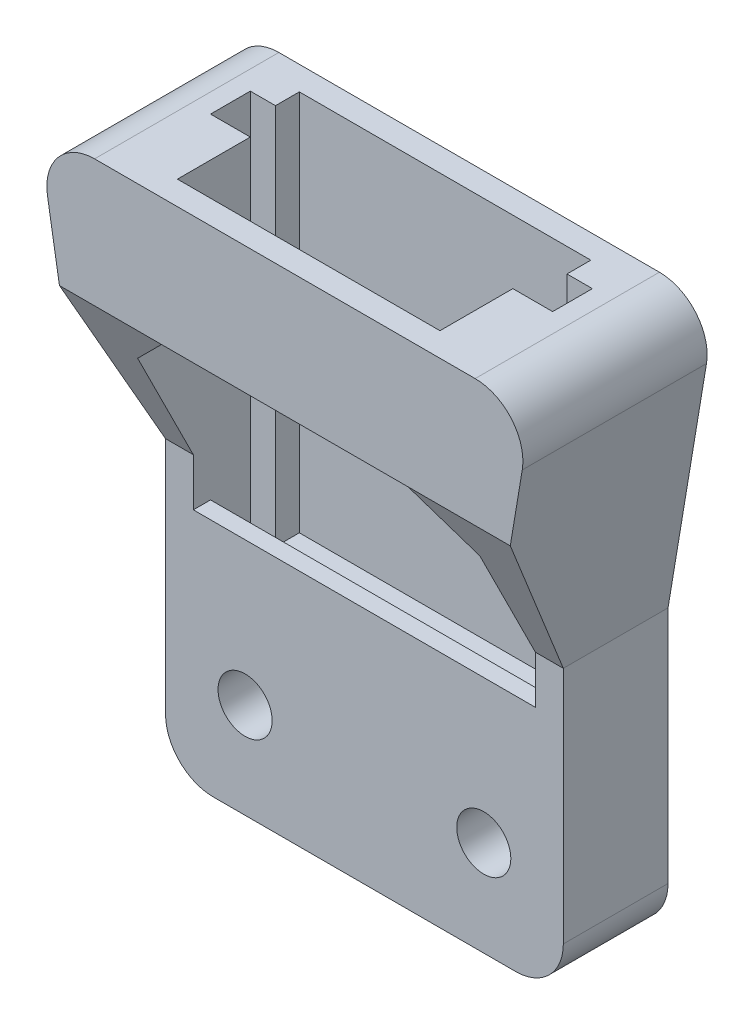
ISO-10303-21;
HEADER;
FILE_DESCRIPTION(('STEP AP214'),'2;1');
FILE_NAME('part.step','',(''),(''),'','','');
FILE_SCHEMA(('AUTOMOTIVE_DESIGN { 1 0 10303 214 1 1 1 1 }'));
ENDSEC;
DATA;
#1=APPLICATION_CONTEXT('core data for automotive mechanical design processes');
#2=APPLICATION_PROTOCOL_DEFINITION('international standard','automotive_design',2000,#1);
#3=PRODUCT_CONTEXT('',#1,'mechanical');
#4=PRODUCT('Part','Part','',(#3));
#5=PRODUCT_RELATED_PRODUCT_CATEGORY('part','',(#4));
#6=PRODUCT_DEFINITION_FORMATION('','',#4);
#7=PRODUCT_DEFINITION_CONTEXT('part definition',#1,'design');
#8=PRODUCT_DEFINITION('design','',#6,#7);
#9=PRODUCT_DEFINITION_SHAPE('','',#8);
#10=(LENGTH_UNIT() NAMED_UNIT(*) SI_UNIT(.MILLI.,.METRE.));
#11=(NAMED_UNIT(*) PLANE_ANGLE_UNIT() SI_UNIT($,.RADIAN.));
#12=(NAMED_UNIT(*) SI_UNIT($,.STERADIAN.) SOLID_ANGLE_UNIT());
#13=UNCERTAINTY_MEASURE_WITH_UNIT(LENGTH_MEASURE(1.E-05),#10,'distance_accuracy_value','');
#14=(GEOMETRIC_REPRESENTATION_CONTEXT(3) GLOBAL_UNCERTAINTY_ASSIGNED_CONTEXT((#13)) GLOBAL_UNIT_ASSIGNED_CONTEXT((#10,
#11,#12)) REPRESENTATION_CONTEXT('',''));
#15=CARTESIAN_POINT('',(0.,0.,0.));
#16=DIRECTION('',(0.,0.,1.));
#17=DIRECTION('',(1.,0.,0.));
#18=AXIS2_PLACEMENT_3D('',#15,#16,#17);
#19=CARTESIAN_POINT('',(-10.75265360096,-119.,-47.5078940808788));
#20=DIRECTION('',(1.,0.,0.));
#21=DIRECTION('',(0.,1.,0.));
#22=AXIS2_PLACEMENT_3D('',#19,#20,#21);
#23=PLANE('',#22);
#24=DIRECTION('',(0.,1.,0.));
#25=VECTOR('',#24,1.);
#26=CARTESIAN_POINT('',(-10.75265360096,-127.,5.49999999999998));
#27=LINE('',#26,#25);
#28=CARTESIAN_POINT('',(-10.75265360096,-130.,5.49999999999998));
#29=VERTEX_POINT('',#28);
#30=CARTESIAN_POINT('',(-10.75265360096,-119.,5.49999999999998));
#31=VERTEX_POINT('',#30);
#32=EDGE_CURVE('E313',#29,#31,#27,.T.);
#33=ORIENTED_EDGE('',*,*,#32,.F.);
#34=DIRECTION('',(0.,0.,1.));
#35=VECTOR('',#34,1.);
#36=CARTESIAN_POINT('',(-10.75265360096,-130.,-47.5078940808788));
#37=LINE('',#36,#35);
#38=CARTESIAN_POINT('',(-10.75265360096,-130.,10.0800000000001));
#39=VERTEX_POINT('',#38);
#40=EDGE_CURVE('E426',#29,#39,#37,.T.);
#41=ORIENTED_EDGE('',*,*,#40,.T.);
#42=DIRECTION('',(0.,-0.894427190999916,-0.447213595499957));
#43=VECTOR('',#42,1.);
#44=CARTESIAN_POINT('',(-10.75265360096,-144.235157632352,2.96242118382435));
#45=LINE('',#44,#43);
#46=CARTESIAN_POINT('',(-10.75265360096,-137.,6.58000000000013));
#47=VERTEX_POINT('',#46);
#48=EDGE_CURVE('E418',#39,#47,#45,.T.);
#49=ORIENTED_EDGE('',*,*,#48,.T.);
#50=DIRECTION('',(0.,1.,0.));
#51=VECTOR('',#50,1.);
#52=CARTESIAN_POINT('',(-10.75265360096,-119.,6.58000000000013));
#53=LINE('',#52,#51);
#54=CARTESIAN_POINT('',(-10.75265360096,-140.,6.58000000000013));
#55=VERTEX_POINT('',#54);
#56=EDGE_CURVE('E278',#55,#47,#53,.T.);
#57=ORIENTED_EDGE('',*,*,#56,.F.);
#58=DIRECTION('',(0.,0.,-1.));
#59=VECTOR('',#58,1.);
#60=CARTESIAN_POINT('',(-10.75265360096,-140.,33.9015142855497));
#61=LINE('',#60,#59);
#62=CARTESIAN_POINT('',(-10.75265360096,-140.,5.49999999999999));
#63=VERTEX_POINT('',#62);
#64=EDGE_CURVE('E330',#55,#63,#61,.T.);
#65=ORIENTED_EDGE('',*,*,#64,.T.);
#66=DIRECTION('',(0.,-1.,0.));
#67=VECTOR('',#66,1.);
#68=CARTESIAN_POINT('',(-10.7526536009601,0.,5.49999999999999));
#69=LINE('',#68,#67);
#70=CARTESIAN_POINT('',(-10.75265360096,-146.,5.49999999999999));
#71=VERTEX_POINT('',#70);
#72=EDGE_CURVE('E327',#63,#71,#69,.T.);
#73=ORIENTED_EDGE('',*,*,#72,.T.);
#74=DIRECTION('',(0.,0.,1.));
#75=VECTOR('',#74,1.);
#76=CARTESIAN_POINT('',(-10.75265360096,-146.,-47.5078940808788));
#77=LINE('',#76,#75);
#78=CARTESIAN_POINT('',(-10.75265360096,-146.,2.99999999999997));
#79=VERTEX_POINT('',#78);
#80=EDGE_CURVE('E350',#79,#71,#77,.T.);
#81=ORIENTED_EDGE('',*,*,#80,.F.);
#82=DIRECTION('',(0.,1.,0.));
#83=VECTOR('',#82,1.);
#84=CARTESIAN_POINT('',(-10.75265360096,-132.3,2.99999999999998));
#85=LINE('',#84,#83);
#86=CARTESIAN_POINT('',(-10.75265360096,-119.,2.99999999999998));
#87=VERTEX_POINT('',#86);
#88=EDGE_CURVE('E407',#79,#87,#85,.T.);
#89=ORIENTED_EDGE('',*,*,#88,.T.);
#90=DIRECTION('',(0.,0.,1.));
#91=VECTOR('',#90,1.);
#92=CARTESIAN_POINT('',(-10.75265360096,-119.,-47.5078940808788));
#93=LINE('',#92,#91);
#94=EDGE_CURVE('E345',#87,#31,#93,.T.);
#95=ORIENTED_EDGE('',*,*,#94,.T.);
#96=EDGE_LOOP('',(#33,#41,#49,#57,#65,#73,#81,#89,#95));
#97=FACE_BOUND('',#96,.T.);
#98=ADVANCED_FACE('F41',(#97),#23,.T.);
#99=CARTESIAN_POINT('',(10.74734639904,-146.,-47.5078940808788));
#100=DIRECTION('',(0.,1.,0.));
#101=DIRECTION('',(0.,0.,1.));
#102=AXIS2_PLACEMENT_3D('',#99,#100,#101);
#103=PLANE('',#102);
#104=ORIENTED_EDGE('',*,*,#80,.T.);
#105=DIRECTION('',(1.,0.,0.));
#106=VECTOR('',#105,1.);
#107=CARTESIAN_POINT('',(0.,-146.,5.49999999999999));
#108=LINE('',#107,#106);
#109=CARTESIAN_POINT('',(10.74734639904,-146.,5.49999999999999));
#110=VERTEX_POINT('',#109);
#111=EDGE_CURVE('E324',#71,#110,#108,.T.);
#112=ORIENTED_EDGE('',*,*,#111,.T.);
#113=DIRECTION('',(0.,0.,1.));
#114=VECTOR('',#113,1.);
#115=CARTESIAN_POINT('',(10.74734639904,-146.,-47.5078940808788));
#116=LINE('',#115,#114);
#117=CARTESIAN_POINT('',(10.74734639904,-146.,2.99999999999997));
#118=VERTEX_POINT('',#117);
#119=EDGE_CURVE('E353',#118,#110,#116,.T.);
#120=ORIENTED_EDGE('',*,*,#119,.F.);
#121=DIRECTION('',(-1.,0.,0.));
#122=VECTOR('',#121,1.);
#123=CARTESIAN_POINT('',(-0.0106144039450154,-146.,2.99999999999997));
#124=LINE('',#123,#122);
#125=EDGE_CURVE('E404',#118,#79,#124,.T.);
#126=ORIENTED_EDGE('',*,*,#125,.T.);
#127=EDGE_LOOP('',(#104,#112,#120,#126));
#128=FACE_BOUND('',#127,.T.);
#129=ADVANCED_FACE('F526',(#128),#103,.T.);
#130=CARTESIAN_POINT('',(0.,0.,0.));
#131=DIRECTION('',(0.,0.,1.));
#132=DIRECTION('',(1.,0.,0.));
#133=AXIS2_PLACEMENT_3D('',#130,#131,#132);
#134=PLANE('',#133);
#135=CARTESIAN_POINT('',(7.50000000000001,-149.,0.));
#136=DIRECTION('',(0.,0.,1.));
#137=DIRECTION('',(1.,0.,0.));
#138=AXIS2_PLACEMENT_3D('',#135,#136,#137);
#139=CIRCLE('',#138,1.7);
#140=CARTESIAN_POINT('',(9.20000000000001,-149.,0.));
#141=VERTEX_POINT('',#140);
#142=EDGE_CURVE('E1064',#141,#141,#139,.T.);
#143=ORIENTED_EDGE('',*,*,#142,.T.);
#144=EDGE_LOOP('',(#143));
#145=FACE_BOUND('',#144,.T.);
#146=CARTESIAN_POINT('',(-7.49999999999999,-149.,0.));
#147=DIRECTION('',(0.,0.,1.));
#148=DIRECTION('',(1.,0.,0.));
#149=AXIS2_PLACEMENT_3D('',#146,#147,#148);
#150=CIRCLE('',#149,1.7);
#151=CARTESIAN_POINT('',(-5.79999999999999,-149.,0.));
#152=VERTEX_POINT('',#151);
#153=EDGE_CURVE('E1074',#152,#152,#150,.T.);
#154=ORIENTED_EDGE('',*,*,#153,.T.);
#155=EDGE_LOOP('',(#154));
#156=FACE_BOUND('',#155,.T.);
#157=DIRECTION('',(1.,0.,0.));
#158=VECTOR('',#157,1.);
#159=CARTESIAN_POINT('',(-12.5,-155.,0.));
#160=LINE('',#159,#158);
#161=CARTESIAN_POINT('',(-9.5,-155.,0.));
#162=VERTEX_POINT('',#161);
#163=CARTESIAN_POINT('',(9.5,-155.,0.));
#164=VERTEX_POINT('',#163);
#165=EDGE_CURVE('E393',#162,#164,#160,.T.);
#166=ORIENTED_EDGE('',*,*,#165,.F.);
#167=CARTESIAN_POINT('',(-9.5,-152.,0.));
#168=DIRECTION('',(0.,0.,1.));
#169=DIRECTION('',(1.,0.,0.));
#170=AXIS2_PLACEMENT_3D('',#167,#168,#169);
#171=CIRCLE('',#170,3.);
#172=CARTESIAN_POINT('',(-12.5,-152.,0.));
#173=VERTEX_POINT('',#172);
#174=EDGE_CURVE('E477',#162,#173,#171,.F.);
#175=ORIENTED_EDGE('',*,*,#174,.T.);
#176=DIRECTION('',(0.,-1.,0.));
#177=VECTOR('',#176,1.);
#178=CARTESIAN_POINT('',(-12.5,-119.,0.));
#179=LINE('',#178,#177);
#180=CARTESIAN_POINT('',(-12.5,-137.,0.));
#181=VERTEX_POINT('',#180);
#182=EDGE_CURVE('E398',#181,#173,#179,.T.);
#183=ORIENTED_EDGE('',*,*,#182,.F.);
#184=DIRECTION('',(-0.164398987305358,0.986393923832144,0.));
#185=VECTOR('',#184,1.);
#186=CARTESIAN_POINT('',(-15.5,-119.,0.));
#187=LINE('',#186,#185);
#188=CARTESIAN_POINT('',(-14.9178005063473,-122.493196961916,0.));
#189=VERTEX_POINT('',#188);
#190=EDGE_CURVE('E341',#181,#189,#187,.T.);
#191=ORIENTED_EDGE('',*,*,#190,.T.);
#192=CARTESIAN_POINT('',(-11.9586187348509,-122.,0.));
#193=DIRECTION('',(0.,0.,1.));
#194=DIRECTION('',(1.,0.,0.));
#195=AXIS2_PLACEMENT_3D('',#192,#193,#194);
#196=CIRCLE('',#195,3.);
#197=CARTESIAN_POINT('',(-11.9586187348509,-119.,0.));
#198=VERTEX_POINT('',#197);
#199=EDGE_CURVE('E464',#189,#198,#196,.F.);
#200=ORIENTED_EDGE('',*,*,#199,.T.);
#201=DIRECTION('',(-1.,0.,0.));
#202=VECTOR('',#201,1.);
#203=CARTESIAN_POINT('',(-12.5,-119.,0.));
#204=LINE('',#203,#202);
#205=CARTESIAN_POINT('',(11.9586187348509,-119.,0.));
#206=VERTEX_POINT('',#205);
#207=EDGE_CURVE('E395',#206,#198,#204,.T.);
#208=ORIENTED_EDGE('',*,*,#207,.F.);
#209=CARTESIAN_POINT('',(11.9586187348509,-122.,0.));
#210=DIRECTION('',(0.,0.,1.));
#211=DIRECTION('',(1.,0.,0.));
#212=AXIS2_PLACEMENT_3D('',#209,#210,#211);
#213=CIRCLE('',#212,3.);
#214=CARTESIAN_POINT('',(14.9178005063473,-122.493196961916,0.));
#215=VERTEX_POINT('',#214);
#216=EDGE_CURVE('E466',#206,#215,#213,.F.);
#217=ORIENTED_EDGE('',*,*,#216,.T.);
#218=DIRECTION('',(-0.164398987305358,-0.986393923832144,0.));
#219=VECTOR('',#218,1.);
#220=CARTESIAN_POINT('',(15.5,-119.,0.));
#221=LINE('',#220,#219);
#222=CARTESIAN_POINT('',(12.5,-137.,0.));
#223=VERTEX_POINT('',#222);
#224=EDGE_CURVE('E344',#215,#223,#221,.T.);
#225=ORIENTED_EDGE('',*,*,#224,.T.);
#226=DIRECTION('',(0.,1.,0.));
#227=VECTOR('',#226,1.);
#228=CARTESIAN_POINT('',(12.5,-119.,0.));
#229=LINE('',#228,#227);
#230=CARTESIAN_POINT('',(12.5,-152.,0.));
#231=VERTEX_POINT('',#230);
#232=EDGE_CURVE('E268',#231,#223,#229,.T.);
#233=ORIENTED_EDGE('',*,*,#232,.F.);
#234=CARTESIAN_POINT('',(9.5,-152.,0.));
#235=DIRECTION('',(0.,0.,1.));
#236=DIRECTION('',(1.,0.,0.));
#237=AXIS2_PLACEMENT_3D('',#234,#235,#236);
#238=CIRCLE('',#237,3.);
#239=EDGE_CURVE('E475',#231,#164,#238,.F.);
#240=ORIENTED_EDGE('',*,*,#239,.T.);
#241=EDGE_LOOP('',(#166,#175,#183,#191,#200,#208,#217,#225,#233,#240));
#242=FACE_BOUND('',#241,.T.);
#243=ADVANCED_FACE('F492',(#145,#156,#242),#134,.F.);
#244=CARTESIAN_POINT('',(-12.5,-155.,45.3292140016222));
#245=DIRECTION('',(0.,1.,0.));
#246=DIRECTION('',(0.,0.,1.));
#247=AXIS2_PLACEMENT_3D('',#244,#245,#246);
#248=PLANE('',#247);
#249=DIRECTION('',(1.,0.,0.));
#250=VECTOR('',#249,1.);
#251=CARTESIAN_POINT('',(-12.5,-155.,6.58000000000013));
#252=LINE('',#251,#250);
#253=CARTESIAN_POINT('',(-9.5,-155.,6.58000000000013));
#254=VERTEX_POINT('',#253);
#255=CARTESIAN_POINT('',(9.5,-155.,6.58000000000013));
#256=VERTEX_POINT('',#255);
#257=EDGE_CURVE('E249',#254,#256,#252,.T.);
#258=ORIENTED_EDGE('',*,*,#257,.F.);
#259=DIRECTION('',(0.,0.,-1.));
#260=VECTOR('',#259,1.);
#261=CARTESIAN_POINT('',(-9.5,-155.,45.3292140016222));
#262=LINE('',#261,#260);
#263=EDGE_CURVE('E472',#254,#162,#262,.T.);
#264=ORIENTED_EDGE('',*,*,#263,.T.);
#265=ORIENTED_EDGE('',*,*,#165,.T.);
#266=DIRECTION('',(0.,0.,-1.));
#267=VECTOR('',#266,1.);
#268=CARTESIAN_POINT('',(9.5,-155.,45.3292140016222));
#269=LINE('',#268,#267);
#270=EDGE_CURVE('E470',#164,#256,#269,.F.);
#271=ORIENTED_EDGE('',*,*,#270,.T.);
#272=EDGE_LOOP('',(#258,#264,#265,#271));
#273=FACE_BOUND('',#272,.T.);
#274=ADVANCED_FACE('F486',(#273),#248,.F.);
#275=CARTESIAN_POINT('',(-12.5,-119.,45.3292140016222));
#276=DIRECTION('',(1.,0.,0.));
#277=DIRECTION('',(0.,0.,-1.));
#278=AXIS2_PLACEMENT_3D('',#275,#276,#277);
#279=PLANE('',#278);
#280=ORIENTED_EDGE('',*,*,#182,.T.);
#281=DIRECTION('',(0.,0.,-1.));
#282=VECTOR('',#281,1.);
#283=CARTESIAN_POINT('',(-12.5,-152.,45.3292140016222));
#284=LINE('',#283,#282);
#285=CARTESIAN_POINT('',(-12.5,-152.,6.58000000000013));
#286=VERTEX_POINT('',#285);
#287=EDGE_CURVE('E64',#173,#286,#284,.F.);
#288=ORIENTED_EDGE('',*,*,#287,.T.);
#289=DIRECTION('',(0.,-1.,0.));
#290=VECTOR('',#289,1.);
#291=CARTESIAN_POINT('',(-12.5,-155.,6.58000000000013));
#292=LINE('',#291,#290);
#293=CARTESIAN_POINT('',(-12.5,-137.,6.58000000000013));
#294=VERTEX_POINT('',#293);
#295=EDGE_CURVE('E482',#294,#286,#292,.T.);
#296=ORIENTED_EDGE('',*,*,#295,.F.);
#297=DIRECTION('',(0.,0.,1.));
#298=VECTOR('',#297,1.);
#299=CARTESIAN_POINT('',(-12.5,-137.,-47.5078940808788));
#300=LINE('',#299,#298);
#301=EDGE_CURVE('E271',#181,#294,#300,.T.);
#302=ORIENTED_EDGE('',*,*,#301,.F.);
#303=EDGE_LOOP('',(#280,#288,#296,#302));
#304=FACE_BOUND('',#303,.T.);
#305=ADVANCED_FACE('F494',(#304),#279,.F.);
#306=CARTESIAN_POINT('',(-12.5,-119.,45.3292140016222));
#307=DIRECTION('',(0.,-1.,0.));
#308=DIRECTION('',(0.,0.,-1.));
#309=AXIS2_PLACEMENT_3D('',#306,#307,#308);
#310=PLANE('',#309);
#311=DIRECTION('',(1.,0.,0.));
#312=VECTOR('',#311,1.);
#313=CARTESIAN_POINT('',(0.,-119.,5.49999999999998));
#314=LINE('',#313,#312);
#315=CARTESIAN_POINT('',(-8.25265360096004,-119.,5.49999999999998));
#316=VERTEX_POINT('',#315);
#317=EDGE_CURVE('E302',#31,#316,#314,.T.);
#318=ORIENTED_EDGE('',*,*,#317,.F.);
#319=ORIENTED_EDGE('',*,*,#94,.F.);
#320=DIRECTION('',(-1.,0.,0.));
#321=VECTOR('',#320,1.);
#322=CARTESIAN_POINT('',(0.,-119.,2.99999999999998));
#323=LINE('',#322,#321);
#324=CARTESIAN_POINT('',(-9.17061440394502,-119.,2.99999999999998));
#325=VERTEX_POINT('',#324);
#326=EDGE_CURVE('E370',#325,#87,#323,.T.);
#327=ORIENTED_EDGE('',*,*,#326,.F.);
#328=DIRECTION('',(0.,0.,-1.));
#329=VECTOR('',#328,1.);
#330=CARTESIAN_POINT('',(-9.17061440394502,-119.,46.8292140016222));
#331=LINE('',#330,#329);
#332=CARTESIAN_POINT('',(-9.17061440394502,-119.,1.50000000000001));
#333=VERTEX_POINT('',#332);
#334=EDGE_CURVE('E363',#325,#333,#331,.T.);
#335=ORIENTED_EDGE('',*,*,#334,.T.);
#336=DIRECTION('',(1.,0.,0.));
#337=VECTOR('',#336,1.);
#338=CARTESIAN_POINT('',(-12.5,-119.,1.50000000000001));
#339=LINE('',#338,#337);
#340=CARTESIAN_POINT('',(9.14938559605499,-119.,1.49999999999999));
#341=VERTEX_POINT('',#340);
#342=EDGE_CURVE('E389',#333,#341,#339,.T.);
#343=ORIENTED_EDGE('',*,*,#342,.T.);
#344=DIRECTION('',(0.,0.,-1.));
#345=VECTOR('',#344,1.);
#346=CARTESIAN_POINT('',(9.14938559605499,-119.,46.8292140016222));
#347=LINE('',#346,#345);
#348=CARTESIAN_POINT('',(9.14938559605499,-119.,2.99999999999998));
#349=VERTEX_POINT('',#348);
#350=EDGE_CURVE('E347',#349,#341,#347,.T.);
#351=ORIENTED_EDGE('',*,*,#350,.F.);
#352=DIRECTION('',(-1.,0.,0.));
#353=VECTOR('',#352,1.);
#354=CARTESIAN_POINT('',(0.,-119.,2.99999999999998));
#355=LINE('',#354,#353);
#356=CARTESIAN_POINT('',(10.74734639904,-119.,2.99999999999998));
#357=VERTEX_POINT('',#356);
#358=EDGE_CURVE('E365',#357,#349,#355,.T.);
#359=ORIENTED_EDGE('',*,*,#358,.F.);
#360=DIRECTION('',(0.,0.,1.));
#361=VECTOR('',#360,1.);
#362=CARTESIAN_POINT('',(10.74734639904,-119.,-47.5078940808788));
#363=LINE('',#362,#361);
#364=CARTESIAN_POINT('',(10.74734639904,-119.,5.49999999999997));
#365=VERTEX_POINT('',#364);
#366=EDGE_CURVE('E270',#357,#365,#363,.T.);
#367=ORIENTED_EDGE('',*,*,#366,.T.);
#368=DIRECTION('',(-1.,0.,0.));
#369=VECTOR('',#368,1.);
#370=CARTESIAN_POINT('',(0.,-119.,5.49999999999997));
#371=LINE('',#370,#369);
#372=CARTESIAN_POINT('',(8.24734639903996,-119.,5.49999999999997));
#373=VERTEX_POINT('',#372);
#374=EDGE_CURVE('E290',#365,#373,#371,.T.);
#375=ORIENTED_EDGE('',*,*,#374,.T.);
#376=DIRECTION('',(0.,0.,-1.));
#377=VECTOR('',#376,1.);
#378=CARTESIAN_POINT('',(8.24734639903996,-119.,0.));
#379=LINE('',#378,#377);
#380=CARTESIAN_POINT('',(8.24734639903996,-119.,10.08));
#381=VERTEX_POINT('',#380);
#382=EDGE_CURVE('E285',#381,#373,#379,.T.);
#383=ORIENTED_EDGE('',*,*,#382,.F.);
#384=DIRECTION('',(-1.,0.,0.));
#385=VECTOR('',#384,1.);
#386=CARTESIAN_POINT('',(0.,-119.,10.08));
#387=LINE('',#386,#385);
#388=CARTESIAN_POINT('',(-8.25265360096004,-119.,10.08));
#389=VERTEX_POINT('',#388);
#390=EDGE_CURVE('E296',#381,#389,#387,.T.);
#391=ORIENTED_EDGE('',*,*,#390,.T.);
#392=DIRECTION('',(0.,0.,-1.));
#393=VECTOR('',#392,1.);
#394=CARTESIAN_POINT('',(-8.25265360096004,-119.,0.));
#395=LINE('',#394,#393);
#396=EDGE_CURVE('E299',#389,#316,#395,.T.);
#397=ORIENTED_EDGE('',*,*,#396,.T.);
#398=EDGE_LOOP('',(#318,#319,#327,#335,#343,#351,#359,#367,#375,#383,#391,#397));
#399=FACE_BOUND('',#398,.T.);
#400=DIRECTION('',(-1.,0.,0.));
#401=VECTOR('',#400,1.);
#402=CARTESIAN_POINT('',(-12.5000000000001,-119.,11.58));
#403=LINE('',#402,#401);
#404=CARTESIAN_POINT('',(11.9586187348509,-119.,11.58));
#405=VERTEX_POINT('',#404);
#406=CARTESIAN_POINT('',(-11.9586187348509,-119.,11.58));
#407=VERTEX_POINT('',#406);
#408=EDGE_CURVE('E333',#405,#407,#403,.T.);
#409=ORIENTED_EDGE('',*,*,#408,.F.);
#410=DIRECTION('',(0.,0.,1.));
#411=VECTOR('',#410,1.);
#412=CARTESIAN_POINT('',(11.9586187348509,-119.,0.));
#413=LINE('',#412,#411);
#414=EDGE_CURVE('E462',#405,#206,#413,.F.);
#415=ORIENTED_EDGE('',*,*,#414,.T.);
#416=ORIENTED_EDGE('',*,*,#207,.T.);
#417=DIRECTION('',(0.,0.,1.));
#418=VECTOR('',#417,1.);
#419=CARTESIAN_POINT('',(-11.9586187348509,-119.,11.58));
#420=LINE('',#419,#418);
#421=EDGE_CURVE('E459',#198,#407,#420,.T.);
#422=ORIENTED_EDGE('',*,*,#421,.T.);
#423=EDGE_LOOP('',(#409,#415,#416,#422));
#424=FACE_BOUND('',#423,.T.);
#425=ADVANCED_FACE('F507',(#399,#424),#310,.F.);
#426=CARTESIAN_POINT('',(12.5,-119.,45.3292140016222));
#427=DIRECTION('',(-1.,0.,0.));
#428=DIRECTION('',(0.,0.,1.));
#429=AXIS2_PLACEMENT_3D('',#426,#427,#428);
#430=PLANE('',#429);
#431=DIRECTION('',(0.,1.,0.));
#432=VECTOR('',#431,1.);
#433=CARTESIAN_POINT('',(12.5,-155.,6.58000000000013));
#434=LINE('',#433,#432);
#435=CARTESIAN_POINT('',(12.5,-152.,6.58000000000013));
#436=VERTEX_POINT('',#435);
#437=CARTESIAN_POINT('',(12.5,-137.,6.58000000000013));
#438=VERTEX_POINT('',#437);
#439=EDGE_CURVE('E239',#436,#438,#434,.T.);
#440=ORIENTED_EDGE('',*,*,#439,.F.);
#441=DIRECTION('',(0.,0.,-1.));
#442=VECTOR('',#441,1.);
#443=CARTESIAN_POINT('',(12.5,-152.,45.3292140016222));
#444=LINE('',#443,#442);
#445=EDGE_CURVE('E11',#436,#231,#444,.T.);
#446=ORIENTED_EDGE('',*,*,#445,.T.);
#447=ORIENTED_EDGE('',*,*,#232,.T.);
#448=DIRECTION('',(0.,0.,1.));
#449=VECTOR('',#448,1.);
#450=CARTESIAN_POINT('',(12.5,-137.,-47.5078940808788));
#451=LINE('',#450,#449);
#452=EDGE_CURVE('E258',#223,#438,#451,.T.);
#453=ORIENTED_EDGE('',*,*,#452,.T.);
#454=EDGE_LOOP('',(#440,#446,#447,#453));
#455=FACE_BOUND('',#454,.T.);
#456=ADVANCED_FACE('F266',(#455),#430,.F.);
#457=CARTESIAN_POINT('',(-6.05541440394505,-125.940199999999,1.5));
#458=DIRECTION('',(0.,0.,-1.));
#459=DIRECTION('',(-2.46320430231736E-12,-1.,0.));
#460=AXIS2_PLACEMENT_3D('',#457,#458,#459);
#461=PLANE('',#460);
#462=ORIENTED_EDGE('',*,*,#342,.F.);
#463=DIRECTION('',(0.,-1.,0.));
#464=VECTOR('',#463,1.);
#465=CARTESIAN_POINT('',(-9.17061440394504,0.,1.50000000000013));
#466=LINE('',#465,#464);
#467=CARTESIAN_POINT('',(-9.17061440394501,-143.,1.50000000000013));
#468=VERTEX_POINT('',#467);
#469=EDGE_CURVE('E360',#333,#468,#466,.T.);
#470=ORIENTED_EDGE('',*,*,#469,.T.);
#471=DIRECTION('',(1.,0.,0.));
#472=VECTOR('',#471,1.);
#473=CARTESIAN_POINT('',(0.,-143.,1.50000000000013));
#474=LINE('',#473,#472);
#475=CARTESIAN_POINT('',(9.14938559605498,-143.,1.50000000000013));
#476=VERTEX_POINT('',#475);
#477=EDGE_CURVE('E362',#468,#476,#474,.T.);
#478=ORIENTED_EDGE('',*,*,#477,.T.);
#479=DIRECTION('',(0.,-1.,0.));
#480=VECTOR('',#479,1.);
#481=CARTESIAN_POINT('',(9.14938559605501,0.,1.50000000000013));
#482=LINE('',#481,#480);
#483=EDGE_CURVE('E366',#341,#476,#482,.T.);
#484=ORIENTED_EDGE('',*,*,#483,.F.);
#485=EDGE_LOOP('',(#462,#470,#478,#484));
#486=FACE_BOUND('',#485,.T.);
#487=ADVANCED_FACE('F557',(#486),#461,.F.);
#488=CARTESIAN_POINT('',(9.14938559605501,0.,46.8292140016222));
#489=DIRECTION('',(1.,0.,0.));
#490=DIRECTION('',(0.,1.,0.));
#491=AXIS2_PLACEMENT_3D('',#488,#489,#490);
#492=PLANE('',#491);
#493=DIRECTION('',(0.,-1.,0.));
#494=VECTOR('',#493,1.);
#495=CARTESIAN_POINT('',(9.14938559605501,0.,2.99999999999999));
#496=LINE('',#495,#494);
#497=CARTESIAN_POINT('',(9.14938559605498,-143.,2.99999999999998));
#498=VERTEX_POINT('',#497);
#499=EDGE_CURVE('E372',#349,#498,#496,.T.);
#500=ORIENTED_EDGE('',*,*,#499,.F.);
#501=ORIENTED_EDGE('',*,*,#350,.T.);
#502=ORIENTED_EDGE('',*,*,#483,.T.);
#503=DIRECTION('',(0.,0.,-1.));
#504=VECTOR('',#503,1.);
#505=CARTESIAN_POINT('',(9.14938559605498,-143.,46.8292140016222));
#506=LINE('',#505,#504);
#507=EDGE_CURVE('E376',#498,#476,#506,.T.);
#508=ORIENTED_EDGE('',*,*,#507,.F.);
#509=EDGE_LOOP('',(#500,#501,#502,#508));
#510=FACE_BOUND('',#509,.T.);
#511=ADVANCED_FACE('F553',(#510),#492,.F.);
#512=CARTESIAN_POINT('',(0.,-143.,46.8292140016222));
#513=DIRECTION('',(0.,1.,0.));
#514=DIRECTION('',(0.,0.,1.));
#515=AXIS2_PLACEMENT_3D('',#512,#513,#514);
#516=PLANE('',#515);
#517=DIRECTION('',(0.,0.,-1.));
#518=VECTOR('',#517,1.);
#519=CARTESIAN_POINT('',(-9.17061440394501,-143.,46.8292140016222));
#520=LINE('',#519,#518);
#521=CARTESIAN_POINT('',(-9.17061440394501,-143.,2.99999999999998));
#522=VERTEX_POINT('',#521);
#523=EDGE_CURVE('E375',#522,#468,#520,.T.);
#524=ORIENTED_EDGE('',*,*,#523,.F.);
#525=DIRECTION('',(1.,0.,0.));
#526=VECTOR('',#525,1.);
#527=CARTESIAN_POINT('',(0.,-143.,2.99999999999998));
#528=LINE('',#527,#526);
#529=EDGE_CURVE('E369',#522,#498,#528,.T.);
#530=ORIENTED_EDGE('',*,*,#529,.T.);
#531=ORIENTED_EDGE('',*,*,#507,.T.);
#532=ORIENTED_EDGE('',*,*,#477,.F.);
#533=EDGE_LOOP('',(#524,#530,#531,#532));
#534=FACE_BOUND('',#533,.T.);
#535=ADVANCED_FACE('F549',(#534),#516,.T.);
#536=CARTESIAN_POINT('',(-9.17061440394504,0.,46.8292140016222));
#537=DIRECTION('',(1.,0.,0.));
#538=DIRECTION('',(0.,1.,0.));
#539=AXIS2_PLACEMENT_3D('',#536,#537,#538);
#540=PLANE('',#539);
#541=ORIENTED_EDGE('',*,*,#334,.F.);
#542=DIRECTION('',(0.,-1.,0.));
#543=VECTOR('',#542,1.);
#544=CARTESIAN_POINT('',(-9.17061440394504,0.,2.99999999999999));
#545=LINE('',#544,#543);
#546=EDGE_CURVE('E373',#325,#522,#545,.T.);
#547=ORIENTED_EDGE('',*,*,#546,.T.);
#548=ORIENTED_EDGE('',*,*,#523,.T.);
#549=ORIENTED_EDGE('',*,*,#469,.F.);
#550=EDGE_LOOP('',(#541,#547,#548,#549));
#551=FACE_BOUND('',#550,.T.);
#552=ADVANCED_FACE('F546',(#551),#540,.T.);
#553=CARTESIAN_POINT('',(-0.0106144039450154,-132.3,2.99999999999998));
#554=DIRECTION('',(0.,0.,1.));
#555=DIRECTION('',(0.,-1.,0.));
#556=AXIS2_PLACEMENT_3D('',#553,#554,#555);
#557=PLANE('',#556);
#558=ORIENTED_EDGE('',*,*,#88,.F.);
#559=ORIENTED_EDGE('',*,*,#125,.F.);
#560=DIRECTION('',(0.,-1.,0.));
#561=VECTOR('',#560,1.);
#562=CARTESIAN_POINT('',(10.74734639904,-132.3,2.99999999999998));
#563=LINE('',#562,#561);
#564=EDGE_CURVE('E392',#357,#118,#563,.T.);
#565=ORIENTED_EDGE('',*,*,#564,.F.);
#566=ORIENTED_EDGE('',*,*,#358,.T.);
#567=ORIENTED_EDGE('',*,*,#499,.T.);
#568=ORIENTED_EDGE('',*,*,#529,.F.);
#569=ORIENTED_EDGE('',*,*,#546,.F.);
#570=ORIENTED_EDGE('',*,*,#326,.T.);
#571=EDGE_LOOP('',(#558,#559,#565,#566,#567,#568,#569,#570));
#572=FACE_BOUND('',#571,.T.);
#573=ADVANCED_FACE('F540',(#572),#557,.T.);
#574=CARTESIAN_POINT('',(10.74734639904,-119.,-47.5078940808788));
#575=DIRECTION('',(-1.,0.,0.));
#576=DIRECTION('',(0.,-1.,0.));
#577=AXIS2_PLACEMENT_3D('',#574,#575,#576);
#578=PLANE('',#577);
#579=DIRECTION('',(0.,0.894427190999916,0.447213595499957));
#580=VECTOR('',#579,1.);
#581=CARTESIAN_POINT('',(10.74734639904,-144.235157632352,2.96242118382434));
#582=LINE('',#581,#580);
#583=CARTESIAN_POINT('',(10.74734639904,-137.,6.58000000000013));
#584=VERTEX_POINT('',#583);
#585=CARTESIAN_POINT('',(10.74734639904,-130.,10.0800000000001));
#586=VERTEX_POINT('',#585);
#587=EDGE_CURVE('E275',#584,#586,#582,.T.);
#588=ORIENTED_EDGE('',*,*,#587,.T.);
#589=DIRECTION('',(0.,0.,-1.));
#590=VECTOR('',#589,1.);
#591=CARTESIAN_POINT('',(10.74734639904,-130.,-47.5078940808788));
#592=LINE('',#591,#590);
#593=CARTESIAN_POINT('',(10.74734639904,-130.,5.49999999999997));
#594=VERTEX_POINT('',#593);
#595=EDGE_CURVE('E428',#586,#594,#592,.T.);
#596=ORIENTED_EDGE('',*,*,#595,.T.);
#597=DIRECTION('',(0.,1.,0.));
#598=VECTOR('',#597,1.);
#599=CARTESIAN_POINT('',(10.74734639904,-127.,5.49999999999997));
#600=LINE('',#599,#598);
#601=EDGE_CURVE('E310',#594,#365,#600,.T.);
#602=ORIENTED_EDGE('',*,*,#601,.T.);
#603=ORIENTED_EDGE('',*,*,#366,.F.);
#604=ORIENTED_EDGE('',*,*,#564,.T.);
#605=ORIENTED_EDGE('',*,*,#119,.T.);
#606=DIRECTION('',(0.,1.,0.));
#607=VECTOR('',#606,1.);
#608=CARTESIAN_POINT('',(10.7473463990399,0.,5.49999999999999));
#609=LINE('',#608,#607);
#610=CARTESIAN_POINT('',(10.74734639904,-140.,5.49999999999999));
#611=VERTEX_POINT('',#610);
#612=EDGE_CURVE('E320',#110,#611,#609,.T.);
#613=ORIENTED_EDGE('',*,*,#612,.T.);
#614=DIRECTION('',(0.,0.,-1.));
#615=VECTOR('',#614,1.);
#616=CARTESIAN_POINT('',(10.74734639904,-140.,33.9015142855497));
#617=LINE('',#616,#615);
#618=CARTESIAN_POINT('',(10.74734639904,-140.,6.58000000000013));
#619=VERTEX_POINT('',#618);
#620=EDGE_CURVE('E309',#619,#611,#617,.T.);
#621=ORIENTED_EDGE('',*,*,#620,.F.);
#622=DIRECTION('',(0.,-1.,0.));
#623=VECTOR('',#622,1.);
#624=CARTESIAN_POINT('',(10.74734639904,-119.,6.58000000000013));
#625=LINE('',#624,#623);
#626=EDGE_CURVE('E276',#584,#619,#625,.T.);
#627=ORIENTED_EDGE('',*,*,#626,.F.);
#628=EDGE_LOOP('',(#588,#596,#602,#603,#604,#605,#613,#621,#627));
#629=FACE_BOUND('',#628,.T.);
#630=ADVANCED_FACE('F537',(#629),#578,.T.);
#631=CARTESIAN_POINT('',(15.5,-119.,-47.5078940808788));
#632=DIRECTION('',(0.986393923832144,-0.164398987305358,0.));
#633=DIRECTION('',(0.164398987305358,0.986393923832144,0.));
#634=AXIS2_PLACEMENT_3D('',#631,#632,#633);
#635=PLANE('',#634);
#636=ORIENTED_EDGE('',*,*,#224,.F.);
#637=DIRECTION('',(0.,0.,1.));
#638=VECTOR('',#637,1.);
#639=CARTESIAN_POINT('',(14.9178005063473,-122.493196961916,11.58));
#640=LINE('',#639,#638);
#641=CARTESIAN_POINT('',(14.9178005063473,-122.493196961916,11.58));
#642=VERTEX_POINT('',#641);
#643=EDGE_CURVE('E453',#215,#642,#640,.T.);
#644=ORIENTED_EDGE('',*,*,#643,.T.);
#645=DIRECTION('',(0.164398987305358,0.986393923832144,0.));
#646=VECTOR('',#645,1.);
#647=CARTESIAN_POINT('',(15.5,-119.,11.58));
#648=LINE('',#647,#646);
#649=CARTESIAN_POINT('',(14.1666666666666,-127.,11.58));
#650=VERTEX_POINT('',#649);
#651=EDGE_CURVE('E261',#650,#642,#648,.T.);
#652=ORIENTED_EDGE('',*,*,#651,.F.);
#653=DIRECTION('',(-0.147441956154897,-0.884651736929383,-0.442325868464691));
#654=VECTOR('',#653,1.);
#655=CARTESIAN_POINT('',(11.3855721251601,-143.68656724904,3.23671637548035));
#656=LINE('',#655,#654);
#657=EDGE_CURVE('E255',#650,#438,#656,.T.);
#658=ORIENTED_EDGE('',*,*,#657,.T.);
#659=ORIENTED_EDGE('',*,*,#452,.F.);
#660=EDGE_LOOP('',(#636,#644,#652,#658,#659));
#661=FACE_BOUND('',#660,.T.);
#662=ADVANCED_FACE('F257',(#661),#635,.T.);
#663=CARTESIAN_POINT('',(-15.5,-119.,-47.5078940808788));
#664=DIRECTION('',(-0.986393923832144,-0.164398987305358,0.));
#665=DIRECTION('',(0.164398987305358,-0.986393923832144,0.));
#666=AXIS2_PLACEMENT_3D('',#663,#664,#665);
#667=PLANE('',#666);
#668=DIRECTION('',(0.164398987305358,-0.986393923832144,0.));
#669=VECTOR('',#668,1.);
#670=CARTESIAN_POINT('',(-15.5,-119.,11.58));
#671=LINE('',#670,#669);
#672=CARTESIAN_POINT('',(-14.9178005063473,-122.493196961916,11.58));
#673=VERTEX_POINT('',#672);
#674=CARTESIAN_POINT('',(-14.1666666666666,-127.,11.58));
#675=VERTEX_POINT('',#674);
#676=EDGE_CURVE('E337',#673,#675,#671,.T.);
#677=ORIENTED_EDGE('',*,*,#676,.F.);
#678=DIRECTION('',(0.,0.,1.));
#679=VECTOR('',#678,1.);
#680=CARTESIAN_POINT('',(-14.9178005063473,-122.493196961916,0.));
#681=LINE('',#680,#679);
#682=EDGE_CURVE('E468',#673,#189,#681,.F.);
#683=ORIENTED_EDGE('',*,*,#682,.T.);
#684=ORIENTED_EDGE('',*,*,#190,.F.);
#685=ORIENTED_EDGE('',*,*,#301,.T.);
#686=DIRECTION('',(-0.147441956154897,0.884651736929383,0.442325868464691));
#687=VECTOR('',#686,1.);
#688=CARTESIAN_POINT('',(-11.3855721251601,-143.68656724904,3.23671637548035));
#689=LINE('',#688,#687);
#690=EDGE_CURVE('E263',#294,#675,#689,.T.);
#691=ORIENTED_EDGE('',*,*,#690,.T.);
#692=EDGE_LOOP('',(#677,#683,#684,#685,#691));
#693=FACE_BOUND('',#692,.T.);
#694=ADVANCED_FACE('F497',(#693),#667,.T.);
#695=CARTESIAN_POINT('',(-6.36041440393514,-121.920199999999,11.58));
#696=DIRECTION('',(0.,0.,1.));
#697=DIRECTION('',(-1.,2.46320430231736E-12,0.));
#698=AXIS2_PLACEMENT_3D('',#695,#696,#697);
#699=PLANE('',#698);
#700=ORIENTED_EDGE('',*,*,#651,.T.);
#701=CARTESIAN_POINT('',(11.9586187348509,-122.,11.58));
#702=DIRECTION('',(0.,0.,1.));
#703=DIRECTION('',(0.,-1.,0.));
#704=AXIS2_PLACEMENT_3D('',#701,#702,#703);
#705=CIRCLE('',#704,3.);
#706=EDGE_CURVE('E457',#642,#405,#705,.T.);
#707=ORIENTED_EDGE('',*,*,#706,.T.);
#708=ORIENTED_EDGE('',*,*,#408,.T.);
#709=CARTESIAN_POINT('',(-11.9586187348509,-122.,11.58));
#710=DIRECTION('',(0.,0.,1.));
#711=DIRECTION('',(0.,-1.,0.));
#712=AXIS2_PLACEMENT_3D('',#709,#710,#711);
#713=CIRCLE('',#712,3.);
#714=EDGE_CURVE('E455',#407,#673,#713,.T.);
#715=ORIENTED_EDGE('',*,*,#714,.T.);
#716=ORIENTED_EDGE('',*,*,#676,.T.);
#717=DIRECTION('',(1.,0.,0.));
#718=VECTOR('',#717,1.);
#719=CARTESIAN_POINT('',(-10.75265360096,-127.,11.58));
#720=LINE('',#719,#718);
#721=CARTESIAN_POINT('',(-7.75265360095998,-127.,11.58));
#722=VERTEX_POINT('',#721);
#723=EDGE_CURVE('E413',#675,#722,#720,.T.);
#724=ORIENTED_EDGE('',*,*,#723,.T.);
#725=DIRECTION('',(-1.,0.,0.));
#726=VECTOR('',#725,1.);
#727=CARTESIAN_POINT('',(0.,-127.,11.58));
#728=LINE('',#727,#726);
#729=CARTESIAN_POINT('',(7.74734639903991,-127.,11.58));
#730=VERTEX_POINT('',#729);
#731=EDGE_CURVE('E289',#730,#722,#728,.T.);
#732=ORIENTED_EDGE('',*,*,#731,.F.);
#733=DIRECTION('',(1.,0.,0.));
#734=VECTOR('',#733,1.);
#735=CARTESIAN_POINT('',(12.5,-127.,11.58));
#736=LINE('',#735,#734);
#737=EDGE_CURVE('E264',#730,#650,#736,.T.);
#738=ORIENTED_EDGE('',*,*,#737,.T.);
#739=EDGE_LOOP('',(#700,#707,#708,#715,#716,#724,#732,#738));
#740=FACE_BOUND('',#739,.T.);
#741=ADVANCED_FACE('F510',(#740),#699,.T.);
#742=CARTESIAN_POINT('',(0.,-140.,33.9015142855497));
#743=DIRECTION('',(0.,1.,0.));
#744=DIRECTION('',(0.,0.,1.));
#745=AXIS2_PLACEMENT_3D('',#742,#743,#744);
#746=PLANE('',#745);
#747=DIRECTION('',(-1.,0.,0.));
#748=VECTOR('',#747,1.);
#749=CARTESIAN_POINT('',(0.,-140.,6.58000000000013));
#750=LINE('',#749,#748);
#751=EDGE_CURVE('E410',#619,#55,#750,.T.);
#752=ORIENTED_EDGE('',*,*,#751,.F.);
#753=ORIENTED_EDGE('',*,*,#620,.T.);
#754=DIRECTION('',(1.,0.,0.));
#755=VECTOR('',#754,1.);
#756=CARTESIAN_POINT('',(0.,-140.,5.49999999999999));
#757=LINE('',#756,#755);
#758=EDGE_CURVE('E323',#63,#611,#757,.T.);
#759=ORIENTED_EDGE('',*,*,#758,.F.);
#760=ORIENTED_EDGE('',*,*,#64,.F.);
#761=EDGE_LOOP('',(#752,#753,#759,#760));
#762=FACE_BOUND('',#761,.T.);
#763=ADVANCED_FACE('F781',(#762),#746,.T.);
#764=CARTESIAN_POINT('',(0.,0.,5.49999999999999));
#765=DIRECTION('',(0.,0.,1.));
#766=DIRECTION('',(1.,0.,0.));
#767=AXIS2_PLACEMENT_3D('',#764,#765,#766);
#768=PLANE('',#767);
#769=ORIENTED_EDGE('',*,*,#758,.T.);
#770=ORIENTED_EDGE('',*,*,#612,.F.);
#771=ORIENTED_EDGE('',*,*,#111,.F.);
#772=ORIENTED_EDGE('',*,*,#72,.F.);
#773=EDGE_LOOP('',(#769,#770,#771,#772));
#774=FACE_BOUND('',#773,.T.);
#775=ADVANCED_FACE('F761',(#774),#768,.F.);
#776=CARTESIAN_POINT('',(8.24734639903996,-127.,0.));
#777=DIRECTION('',(1.,0.,0.));
#778=DIRECTION('',(0.,0.,-1.));
#779=AXIS2_PLACEMENT_3D('',#776,#777,#778);
#780=PLANE('',#779);
#781=ORIENTED_EDGE('',*,*,#382,.T.);
#782=DIRECTION('',(0.,1.,0.));
#783=VECTOR('',#782,1.);
#784=CARTESIAN_POINT('',(8.24734639903996,-127.,5.49999999999997));
#785=LINE('',#784,#783);
#786=CARTESIAN_POINT('',(8.24734639903996,-127.5,5.49999999999997));
#787=VERTEX_POINT('',#786);
#788=EDGE_CURVE('E307',#787,#373,#785,.T.);
#789=ORIENTED_EDGE('',*,*,#788,.F.);
#790=DIRECTION('',(0.,0.,1.));
#791=VECTOR('',#790,1.);
#792=CARTESIAN_POINT('',(8.24734639903996,-127.5,0.));
#793=LINE('',#792,#791);
#794=CARTESIAN_POINT('',(8.24734639903996,-127.5,10.08));
#795=VERTEX_POINT('',#794);
#796=EDGE_CURVE('E448',#787,#795,#793,.T.);
#797=ORIENTED_EDGE('',*,*,#796,.T.);
#798=DIRECTION('',(0.,1.,0.));
#799=VECTOR('',#798,1.);
#800=CARTESIAN_POINT('',(8.24734639903996,-127.,10.08));
#801=LINE('',#800,#799);
#802=EDGE_CURVE('E293',#795,#381,#801,.T.);
#803=ORIENTED_EDGE('',*,*,#802,.T.);
#804=EDGE_LOOP('',(#781,#789,#797,#803));
#805=FACE_BOUND('',#804,.T.);
#806=ADVANCED_FACE('F750',(#805),#780,.F.);
#807=CARTESIAN_POINT('',(0.,-127.,5.49999999999997));
#808=DIRECTION('',(0.,0.,-1.));
#809=DIRECTION('',(-1.,0.,0.));
#810=AXIS2_PLACEMENT_3D('',#807,#808,#809);
#811=PLANE('',#810);
#812=ORIENTED_EDGE('',*,*,#374,.F.);
#813=ORIENTED_EDGE('',*,*,#601,.F.);
#814=DIRECTION('',(-0.70710678118655,0.707106781186545,0.));
#815=VECTOR('',#814,1.);
#816=CARTESIAN_POINT('',(7.74734639903991,-127.,5.49999999999997));
#817=LINE('',#816,#815);
#818=EDGE_CURVE('E445',#594,#787,#817,.T.);
#819=ORIENTED_EDGE('',*,*,#818,.T.);
#820=ORIENTED_EDGE('',*,*,#788,.T.);
#821=EDGE_LOOP('',(#812,#813,#819,#820));
#822=FACE_BOUND('',#821,.T.);
#823=ADVANCED_FACE('F740',(#822),#811,.T.);
#824=CARTESIAN_POINT('',(0.,-127.,5.49999999999998));
#825=DIRECTION('',(0.,0.,1.));
#826=DIRECTION('',(1.,0.,0.));
#827=AXIS2_PLACEMENT_3D('',#824,#825,#826);
#828=PLANE('',#827);
#829=ORIENTED_EDGE('',*,*,#317,.T.);
#830=DIRECTION('',(0.,1.,0.));
#831=VECTOR('',#830,1.);
#832=CARTESIAN_POINT('',(-8.25265360096004,-127.,5.49999999999998));
#833=LINE('',#832,#831);
#834=CARTESIAN_POINT('',(-8.25265360096004,-127.5,5.49999999999998));
#835=VERTEX_POINT('',#834);
#836=EDGE_CURVE('E315',#835,#316,#833,.T.);
#837=ORIENTED_EDGE('',*,*,#836,.F.);
#838=DIRECTION('',(-0.70710678118655,-0.707106781186545,0.));
#839=VECTOR('',#838,1.);
#840=CARTESIAN_POINT('',(-3.87632680047996,-123.12367319952,5.49999999999998));
#841=LINE('',#840,#839);
#842=EDGE_CURVE('E437',#835,#29,#841,.T.);
#843=ORIENTED_EDGE('',*,*,#842,.T.);
#844=ORIENTED_EDGE('',*,*,#32,.T.);
#845=EDGE_LOOP('',(#829,#837,#843,#844));
#846=FACE_BOUND('',#845,.T.);
#847=ADVANCED_FACE('F731',(#846),#828,.F.);
#848=CARTESIAN_POINT('',(-8.25265360096004,-127.,0.));
#849=DIRECTION('',(1.,0.,0.));
#850=DIRECTION('',(0.,0.,-1.));
#851=AXIS2_PLACEMENT_3D('',#848,#849,#850);
#852=PLANE('',#851);
#853=ORIENTED_EDGE('',*,*,#396,.F.);
#854=DIRECTION('',(0.,1.,0.));
#855=VECTOR('',#854,1.);
#856=CARTESIAN_POINT('',(-8.25265360096004,-127.,10.08));
#857=LINE('',#856,#855);
#858=CARTESIAN_POINT('',(-8.25265360096004,-127.5,10.08));
#859=VERTEX_POINT('',#858);
#860=EDGE_CURVE('E317',#859,#389,#857,.T.);
#861=ORIENTED_EDGE('',*,*,#860,.F.);
#862=DIRECTION('',(0.,0.,-1.));
#863=VECTOR('',#862,1.);
#864=CARTESIAN_POINT('',(-8.25265360096004,-127.5,0.));
#865=LINE('',#864,#863);
#866=EDGE_CURVE('E434',#859,#835,#865,.T.);
#867=ORIENTED_EDGE('',*,*,#866,.T.);
#868=ORIENTED_EDGE('',*,*,#836,.T.);
#869=EDGE_LOOP('',(#853,#861,#867,#868));
#870=FACE_BOUND('',#869,.T.);
#871=ADVANCED_FACE('F720',(#870),#852,.T.);
#872=CARTESIAN_POINT('',(0.,-127.,10.08));
#873=DIRECTION('',(0.,0.,-1.));
#874=DIRECTION('',(-1.,0.,0.));
#875=AXIS2_PLACEMENT_3D('',#872,#873,#874);
#876=PLANE('',#875);
#877=ORIENTED_EDGE('',*,*,#390,.F.);
#878=ORIENTED_EDGE('',*,*,#802,.F.);
#879=DIRECTION('',(-0.70710678118655,0.707106781186545,0.));
#880=VECTOR('',#879,1.);
#881=CARTESIAN_POINT('',(7.74734639903991,-127.,10.08));
#882=LINE('',#881,#880);
#883=CARTESIAN_POINT('',(7.74734639903991,-127.,10.08));
#884=VERTEX_POINT('',#883);
#885=EDGE_CURVE('E451',#795,#884,#882,.T.);
#886=ORIENTED_EDGE('',*,*,#885,.T.);
#887=DIRECTION('',(-1.,0.,0.));
#888=VECTOR('',#887,1.);
#889=CARTESIAN_POINT('',(0.,-127.,10.08));
#890=LINE('',#889,#888);
#891=CARTESIAN_POINT('',(-7.75265360095998,-127.,10.08));
#892=VERTEX_POINT('',#891);
#893=EDGE_CURVE('E286',#884,#892,#890,.T.);
#894=ORIENTED_EDGE('',*,*,#893,.T.);
#895=DIRECTION('',(-0.70710678118655,-0.707106781186545,0.));
#896=VECTOR('',#895,1.);
#897=CARTESIAN_POINT('',(-7.75265360095998,-127.,10.08));
#898=LINE('',#897,#896);
#899=EDGE_CURVE('E431',#892,#859,#898,.T.);
#900=ORIENTED_EDGE('',*,*,#899,.T.);
#901=ORIENTED_EDGE('',*,*,#860,.T.);
#902=EDGE_LOOP('',(#877,#878,#886,#894,#900,#901));
#903=FACE_BOUND('',#902,.T.);
#904=ADVANCED_FACE('F710',(#903),#876,.T.);
#905=CARTESIAN_POINT('',(0.,-127.,0.));
#906=DIRECTION('',(0.,1.,0.));
#907=DIRECTION('',(0.,0.,1.));
#908=AXIS2_PLACEMENT_3D('',#905,#906,#907);
#909=PLANE('',#908);
#910=ORIENTED_EDGE('',*,*,#731,.T.);
#911=DIRECTION('',(0.,0.,-1.));
#912=VECTOR('',#911,1.);
#913=CARTESIAN_POINT('',(-7.75265360095998,-127.,0.));
#914=LINE('',#913,#912);
#915=EDGE_CURVE('E423',#722,#892,#914,.T.);
#916=ORIENTED_EDGE('',*,*,#915,.T.);
#917=ORIENTED_EDGE('',*,*,#893,.F.);
#918=DIRECTION('',(0.,0.,1.));
#919=VECTOR('',#918,1.);
#920=CARTESIAN_POINT('',(7.74734639903991,-127.,0.));
#921=LINE('',#920,#919);
#922=EDGE_CURVE('E420',#884,#730,#921,.T.);
#923=ORIENTED_EDGE('',*,*,#922,.T.);
#924=EDGE_LOOP('',(#910,#916,#917,#923));
#925=FACE_BOUND('',#924,.T.);
#926=ADVANCED_FACE('F644',(#925),#909,.F.);
#927=CARTESIAN_POINT('',(0.,0.,6.58000000000013));
#928=DIRECTION('',(0.,0.,-1.));
#929=DIRECTION('',(-1.,0.,0.));
#930=AXIS2_PLACEMENT_3D('',#927,#928,#929);
#931=PLANE('',#930);
#932=CARTESIAN_POINT('',(7.50000000000001,-149.,6.58000000000013));
#933=DIRECTION('',(0.,0.,1.));
#934=DIRECTION('',(1.,0.,0.));
#935=AXIS2_PLACEMENT_3D('',#932,#933,#934);
#936=CIRCLE('',#935,1.69999999999999);
#937=CARTESIAN_POINT('',(9.2,-149.,6.58000000000013));
#938=VERTEX_POINT('',#937);
#939=EDGE_CURVE('E1067',#938,#938,#936,.T.);
#940=ORIENTED_EDGE('',*,*,#939,.F.);
#941=EDGE_LOOP('',(#940));
#942=FACE_BOUND('',#941,.T.);
#943=CARTESIAN_POINT('',(-7.49999999999999,-149.,6.58000000000013));
#944=DIRECTION('',(0.,0.,1.));
#945=DIRECTION('',(1.,0.,0.));
#946=AXIS2_PLACEMENT_3D('',#943,#944,#945);
#947=CIRCLE('',#946,1.69999999999999);
#948=CARTESIAN_POINT('',(-5.8,-149.,6.58000000000013));
#949=VERTEX_POINT('',#948);
#950=EDGE_CURVE('E1069',#949,#949,#947,.T.);
#951=ORIENTED_EDGE('',*,*,#950,.F.);
#952=EDGE_LOOP('',(#951));
#953=FACE_BOUND('',#952,.T.);
#954=ORIENTED_EDGE('',*,*,#295,.T.);
#955=CARTESIAN_POINT('',(-9.5,-152.,6.58000000000013));
#956=DIRECTION('',(0.,0.,-1.));
#957=DIRECTION('',(-1.,0.,0.));
#958=AXIS2_PLACEMENT_3D('',#955,#956,#957);
#959=CIRCLE('',#958,3.);
#960=EDGE_CURVE('E49',#286,#254,#959,.F.);
#961=ORIENTED_EDGE('',*,*,#960,.T.);
#962=ORIENTED_EDGE('',*,*,#257,.T.);
#963=CARTESIAN_POINT('',(9.5,-152.,6.58000000000013));
#964=DIRECTION('',(0.,0.,-1.));
#965=DIRECTION('',(-1.,0.,0.));
#966=AXIS2_PLACEMENT_3D('',#963,#964,#965);
#967=CIRCLE('',#966,3.);
#968=EDGE_CURVE('E56',#256,#436,#967,.F.);
#969=ORIENTED_EDGE('',*,*,#968,.T.);
#970=ORIENTED_EDGE('',*,*,#439,.T.);
#971=DIRECTION('',(-1.,0.,0.));
#972=VECTOR('',#971,1.);
#973=CARTESIAN_POINT('',(-12.5,-137.,6.58000000000013));
#974=LINE('',#973,#972);
#975=EDGE_CURVE('E243',#438,#584,#974,.T.);
#976=ORIENTED_EDGE('',*,*,#975,.T.);
#977=ORIENTED_EDGE('',*,*,#626,.T.);
#978=ORIENTED_EDGE('',*,*,#751,.T.);
#979=ORIENTED_EDGE('',*,*,#56,.T.);
#980=EDGE_CURVE('E248',#47,#294,#974,.T.);
#981=ORIENTED_EDGE('',*,*,#980,.T.);
#982=EDGE_LOOP('',(#954,#961,#962,#969,#970,#976,#977,#978,#979,#981));
#983=FACE_BOUND('',#982,.T.);
#984=ADVANCED_FACE('F241',(#942,#953,#983),#931,.F.);
#985=CARTESIAN_POINT('',(-12.5,-137.,6.58000000000014));
#986=DIRECTION('',(0.,-0.447213595499957,0.894427190999916));
#987=DIRECTION('',(1.,0.,0.));
#988=AXIS2_PLACEMENT_3D('',#985,#986,#987);
#989=PLANE('',#988);
#990=ORIENTED_EDGE('',*,*,#657,.F.);
#991=ORIENTED_EDGE('',*,*,#737,.F.);
#992=DIRECTION('',(0.66666666666667,-0.666666666666664,-0.333333333333332));
#993=VECTOR('',#992,1.);
#994=CARTESIAN_POINT('',(10.3206797323733,-129.573333333333,10.2933333333334));
#995=LINE('',#994,#993);
#996=EDGE_CURVE('E443',#730,#586,#995,.T.);
#997=ORIENTED_EDGE('',*,*,#996,.T.);
#998=ORIENTED_EDGE('',*,*,#587,.F.);
#999=ORIENTED_EDGE('',*,*,#975,.F.);
#1000=EDGE_LOOP('',(#990,#991,#997,#998,#999));
#1001=FACE_BOUND('',#1000,.T.);
#1002=ADVANCED_FACE('F273',(#1001),#989,.T.);
#1003=CARTESIAN_POINT('',(-12.5,-137.,6.58000000000012));
#1004=DIRECTION('',(0.,-0.447213595499957,0.894427190999916));
#1005=DIRECTION('',(1.,0.,0.));
#1006=AXIS2_PLACEMENT_3D('',#1003,#1004,#1005);
#1007=PLANE('',#1006);
#1008=ORIENTED_EDGE('',*,*,#48,.F.);
#1009=DIRECTION('',(0.66666666666667,0.666666666666665,0.333333333333331));
#1010=VECTOR('',#1009,1.);
#1011=CARTESIAN_POINT('',(-10.3259869342933,-129.573333333333,10.2933333333334));
#1012=LINE('',#1011,#1010);
#1013=EDGE_CURVE('E440',#39,#722,#1012,.T.);
#1014=ORIENTED_EDGE('',*,*,#1013,.T.);
#1015=ORIENTED_EDGE('',*,*,#723,.F.);
#1016=ORIENTED_EDGE('',*,*,#690,.F.);
#1017=ORIENTED_EDGE('',*,*,#980,.F.);
#1018=EDGE_LOOP('',(#1008,#1014,#1015,#1016,#1017));
#1019=FACE_BOUND('',#1018,.T.);
#1020=ADVANCED_FACE('F583',(#1019),#1007,.T.);
#1021=CARTESIAN_POINT('',(-7.75265360095998,-127.,0.));
#1022=DIRECTION('',(-0.707106781186545,0.70710678118655,0.));
#1023=DIRECTION('',(0.,0.,-1.));
#1024=AXIS2_PLACEMENT_3D('',#1021,#1022,#1023);
#1025=PLANE('',#1024);
#1026=ORIENTED_EDGE('',*,*,#1013,.F.);
#1027=ORIENTED_EDGE('',*,*,#40,.F.);
#1028=ORIENTED_EDGE('',*,*,#842,.F.);
#1029=ORIENTED_EDGE('',*,*,#866,.F.);
#1030=ORIENTED_EDGE('',*,*,#899,.F.);
#1031=ORIENTED_EDGE('',*,*,#915,.F.);
#1032=EDGE_LOOP('',(#1026,#1027,#1028,#1029,#1030,#1031));
#1033=FACE_BOUND('',#1032,.T.);
#1034=ADVANCED_FACE('F589',(#1033),#1025,.F.);
#1035=CARTESIAN_POINT('',(7.74734639903991,-127.,0.));
#1036=DIRECTION('',(0.707106781186545,0.70710678118655,0.));
#1037=DIRECTION('',(0.,0.,1.));
#1038=AXIS2_PLACEMENT_3D('',#1035,#1036,#1037);
#1039=PLANE('',#1038);
#1040=ORIENTED_EDGE('',*,*,#818,.F.);
#1041=ORIENTED_EDGE('',*,*,#595,.F.);
#1042=ORIENTED_EDGE('',*,*,#996,.F.);
#1043=ORIENTED_EDGE('',*,*,#922,.F.);
#1044=ORIENTED_EDGE('',*,*,#885,.F.);
#1045=ORIENTED_EDGE('',*,*,#796,.F.);
#1046=EDGE_LOOP('',(#1040,#1041,#1042,#1043,#1044,#1045));
#1047=FACE_BOUND('',#1046,.T.);
#1048=ADVANCED_FACE('F596',(#1047),#1039,.F.);
#1049=CARTESIAN_POINT('',(11.9586187348509,-122.,-47.5078940808788));
#1050=DIRECTION('',(0.,0.,-1.));
#1051=DIRECTION('',(-1.,0.,0.));
#1052=AXIS2_PLACEMENT_3D('',#1049,#1050,#1051);
#1053=CYLINDRICAL_SURFACE('',#1052,3.);
#1054=ORIENTED_EDGE('',*,*,#216,.F.);
#1055=ORIENTED_EDGE('',*,*,#414,.F.);
#1056=ORIENTED_EDGE('',*,*,#706,.F.);
#1057=ORIENTED_EDGE('',*,*,#643,.F.);
#1058=EDGE_LOOP('',(#1054,#1055,#1056,#1057));
#1059=FACE_BOUND('',#1058,.T.);
#1060=ADVANCED_FACE('F514',(#1059),#1053,.T.);
#1061=CARTESIAN_POINT('',(-11.9586187348509,-122.,45.3292140016222));
#1062=DIRECTION('',(0.,0.,-1.));
#1063=DIRECTION('',(-1.,0.,0.));
#1064=AXIS2_PLACEMENT_3D('',#1061,#1062,#1063);
#1065=CYLINDRICAL_SURFACE('',#1064,3.);
#1066=ORIENTED_EDGE('',*,*,#199,.F.);
#1067=ORIENTED_EDGE('',*,*,#682,.F.);
#1068=ORIENTED_EDGE('',*,*,#714,.F.);
#1069=ORIENTED_EDGE('',*,*,#421,.F.);
#1070=EDGE_LOOP('',(#1066,#1067,#1068,#1069));
#1071=FACE_BOUND('',#1070,.T.);
#1072=ADVANCED_FACE('F504',(#1071),#1065,.T.);
#1073=CARTESIAN_POINT('',(-9.5,-152.,45.3292140016222));
#1074=DIRECTION('',(0.,0.,-1.));
#1075=DIRECTION('',(-1.,0.,0.));
#1076=AXIS2_PLACEMENT_3D('',#1073,#1074,#1075);
#1077=CYLINDRICAL_SURFACE('',#1076,3.);
#1078=ORIENTED_EDGE('',*,*,#960,.F.);
#1079=ORIENTED_EDGE('',*,*,#287,.F.);
#1080=ORIENTED_EDGE('',*,*,#174,.F.);
#1081=ORIENTED_EDGE('',*,*,#263,.F.);
#1082=EDGE_LOOP('',(#1078,#1079,#1080,#1081));
#1083=FACE_BOUND('',#1082,.T.);
#1084=ADVANCED_FACE('F489',(#1083),#1077,.T.);
#1085=CARTESIAN_POINT('',(9.5,-152.,45.3292140016222));
#1086=DIRECTION('',(0.,0.,-1.));
#1087=DIRECTION('',(-1.,0.,0.));
#1088=AXIS2_PLACEMENT_3D('',#1085,#1086,#1087);
#1089=CYLINDRICAL_SURFACE('',#1088,3.);
#1090=ORIENTED_EDGE('',*,*,#968,.F.);
#1091=ORIENTED_EDGE('',*,*,#270,.F.);
#1092=ORIENTED_EDGE('',*,*,#239,.F.);
#1093=ORIENTED_EDGE('',*,*,#445,.F.);
#1094=EDGE_LOOP('',(#1090,#1091,#1092,#1093));
#1095=FACE_BOUND('',#1094,.T.);
#1096=ADVANCED_FACE('F43',(#1095),#1089,.T.);
#1097=CARTESIAN_POINT('',(-7.49999999999999,-149.,6.58000000000013));
#1098=DIRECTION('',(0.,0.,1.));
#1099=DIRECTION('',(1.,0.,0.));
#1100=AXIS2_PLACEMENT_3D('',#1097,#1098,#1099);
#1101=CYLINDRICAL_SURFACE('',#1100,1.69999999999999);
#1102=ORIENTED_EDGE('',*,*,#153,.F.);
#1103=EDGE_LOOP('',(#1102));
#1104=FACE_BOUND('',#1103,.T.);
#1105=ORIENTED_EDGE('',*,*,#950,.T.);
#1106=EDGE_LOOP('',(#1105));
#1107=FACE_BOUND('',#1106,.T.);
#1108=ADVANCED_FACE('F517',(#1104,#1107),#1101,.F.);
#1109=CARTESIAN_POINT('',(7.50000000000001,-149.,6.58000000000013));
#1110=DIRECTION('',(0.,0.,1.));
#1111=DIRECTION('',(1.,0.,0.));
#1112=AXIS2_PLACEMENT_3D('',#1109,#1110,#1111);
#1113=CYLINDRICAL_SURFACE('',#1112,1.69999999999999);
#1114=ORIENTED_EDGE('',*,*,#142,.F.);
#1115=EDGE_LOOP('',(#1114));
#1116=FACE_BOUND('',#1115,.T.);
#1117=ORIENTED_EDGE('',*,*,#939,.T.);
#1118=EDGE_LOOP('',(#1117));
#1119=FACE_BOUND('',#1118,.T.);
#1120=ADVANCED_FACE('F522',(#1116,#1119),#1113,.F.);
#1121=CLOSED_SHELL('',(#98,#129,#243,#274,#305,#425,#456,#487,#511,#535,#552,#573,#630,#662,
#694,#741,#763,#775,#806,#823,#847,#871,#904,#926,#984,#1002,#1020,#1034,#1048,#1060,#1072,
#1084,#1096,#1108,#1120));
#1122=MANIFOLD_SOLID_BREP('B2',#1121);
#1123=ADVANCED_BREP_SHAPE_REPRESENTATION('',(#18,#1122),#14);
#1124=SHAPE_DEFINITION_REPRESENTATION(#9,#1123);
ENDSEC;
END-ISO-10303-21;
